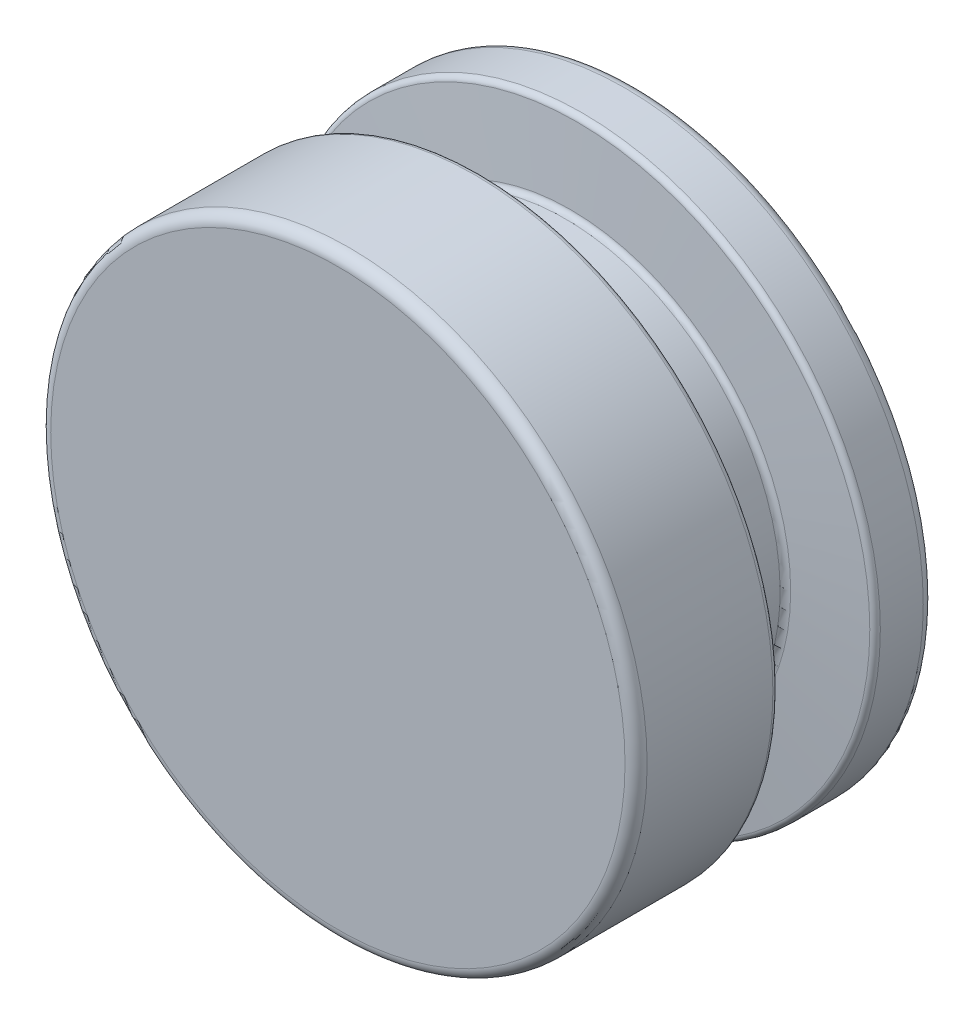
ISO-10303-21;
HEADER;
FILE_DESCRIPTION(('STEP AP214'),'2;1');
FILE_NAME('part.step','',(''),(''),'','','');
FILE_SCHEMA(('AUTOMOTIVE_DESIGN { 1 0 10303 214 1 1 1 1 }'));
ENDSEC;
DATA;
#1=APPLICATION_CONTEXT('core data for automotive mechanical design processes');
#2=APPLICATION_PROTOCOL_DEFINITION('international standard','automotive_design',2000,#1);
#3=PRODUCT_CONTEXT('',#1,'mechanical');
#4=PRODUCT('Part','Part','',(#3));
#5=PRODUCT_RELATED_PRODUCT_CATEGORY('part','',(#4));
#6=PRODUCT_DEFINITION_FORMATION('','',#4);
#7=PRODUCT_DEFINITION_CONTEXT('part definition',#1,'design');
#8=PRODUCT_DEFINITION('design','',#6,#7);
#9=PRODUCT_DEFINITION_SHAPE('','',#8);
#10=(LENGTH_UNIT() NAMED_UNIT(*) SI_UNIT(.MILLI.,.METRE.));
#11=(NAMED_UNIT(*) PLANE_ANGLE_UNIT() SI_UNIT($,.RADIAN.));
#12=(NAMED_UNIT(*) SI_UNIT($,.STERADIAN.) SOLID_ANGLE_UNIT());
#13=UNCERTAINTY_MEASURE_WITH_UNIT(LENGTH_MEASURE(1.E-05),#10,'distance_accuracy_value','');
#14=(GEOMETRIC_REPRESENTATION_CONTEXT(3) GLOBAL_UNCERTAINTY_ASSIGNED_CONTEXT((#13)) GLOBAL_UNIT_ASSIGNED_CONTEXT((#10,
#11,#12)) REPRESENTATION_CONTEXT('',''));
#15=CARTESIAN_POINT('',(0.,0.,0.));
#16=DIRECTION('',(0.,0.,1.));
#17=DIRECTION('',(1.,0.,0.));
#18=AXIS2_PLACEMENT_3D('',#15,#16,#17);
#19=CARTESIAN_POINT('',(0.,0.,-50.8));
#20=DIRECTION('',(0.,0.,1.));
#21=DIRECTION('',(1.,0.,0.));
#22=AXIS2_PLACEMENT_3D('',#19,#20,#21);
#23=CYLINDRICAL_SURFACE('',#22,68.57365);
#24=CARTESIAN_POINT('',(0.,0.,15.24));
#25=DIRECTION('',(0.,0.,1.));
#26=DIRECTION('',(1.,0.,0.));
#27=AXIS2_PLACEMENT_3D('',#24,#25,#26);
#28=CIRCLE('',#27,68.57365);
#29=CARTESIAN_POINT('',(68.57365,0.,15.24));
#30=VERTEX_POINT('',#29);
#31=EDGE_CURVE('E51',#30,#30,#28,.F.);
#32=ORIENTED_EDGE('',*,*,#31,.T.);
#33=EDGE_LOOP('',(#32));
#34=FACE_BOUND('',#33,.T.);
#35=CARTESIAN_POINT('',(0.,0.,-13.679600368829));
#36=DIRECTION('',(0.,0.,-1.));
#37=DIRECTION('',(0.,1.,0.));
#38=AXIS2_PLACEMENT_3D('',#35,#36,#37);
#39=CIRCLE('',#38,68.57365);
#40=CARTESIAN_POINT('',(0.,68.57365,-13.679600368829));
#41=VERTEX_POINT('',#40);
#42=EDGE_CURVE('E60',#41,#41,#39,.F.);
#43=ORIENTED_EDGE('',*,*,#42,.T.);
#44=EDGE_LOOP('',(#43));
#45=FACE_BOUND('',#44,.T.);
#46=ADVANCED_FACE('F40',(#34,#45),#23,.T.);
#47=CARTESIAN_POINT('',(0.,0.,17.78));
#48=DIRECTION('',(0.,0.,1.));
#49=DIRECTION('',(1.,0.,0.));
#50=AXIS2_PLACEMENT_3D('',#47,#48,#49);
#51=PLANE('',#50);
#52=CARTESIAN_POINT('',(0.,0.,17.78));
#53=DIRECTION('',(0.,0.,1.));
#54=DIRECTION('',(1.,0.,0.));
#55=AXIS2_PLACEMENT_3D('',#52,#53,#54);
#56=CIRCLE('',#55,66.03365);
#57=CARTESIAN_POINT('',(66.03365,0.,17.78));
#58=VERTEX_POINT('',#57);
#59=EDGE_CURVE('E55',#58,#58,#56,.T.);
#60=ORIENTED_EDGE('',*,*,#59,.T.);
#61=EDGE_LOOP('',(#60));
#62=FACE_BOUND('',#61,.T.);
#63=ADVANCED_FACE('F96',(#62),#51,.T.);
#64=CARTESIAN_POINT('',(0.,0.,-14.8433409598311));
#65=DIRECTION('',(0.,0.,1.));
#66=DIRECTION('',(0.,-1.,0.));
#67=AXIS2_PLACEMENT_3D('',#64,#65,#66);
#68=CONICAL_SURFACE('',#67,68.57365,1.48352986419518);
#69=CARTESIAN_POINT('',(0.,0.,-16.4085733244257));
#70=DIRECTION('',(0.,0.,1.));
#71=DIRECTION('',(0.,-1.,0.));
#72=AXIS2_PLACEMENT_3D('',#69,#70,#71);
#73=CIRCLE('',#72,50.6829622067105);
#74=CARTESIAN_POINT('',(0.,-50.6829622067105,-16.4085733244257));
#75=VERTEX_POINT('',#74);
#76=EDGE_CURVE('E78',#75,#75,#73,.T.);
#77=ORIENTED_EDGE('',*,*,#76,.T.);
#78=EDGE_LOOP('',(#77));
#79=FACE_BOUND('',#78,.T.);
#80=CARTESIAN_POINT('',(0.,0.,-14.9447676354055));
#81=DIRECTION('',(0.,0.,-1.));
#82=DIRECTION('',(0.,1.,0.));
#83=AXIS2_PLACEMENT_3D('',#80,#81,#82);
#84=CIRCLE('',#83,67.4143377932895);
#85=CARTESIAN_POINT('',(0.,67.4143377932895,-14.9447676354055));
#86=VERTEX_POINT('',#85);
#87=EDGE_CURVE('E81',#86,#86,#84,.T.);
#88=ORIENTED_EDGE('',*,*,#87,.T.);
#89=EDGE_LOOP('',(#88));
#90=FACE_BOUND('',#89,.T.);
#91=ADVANCED_FACE('F85',(#79,#90),#68,.T.);
#92=CARTESIAN_POINT('',(0.,0.,-35.56));
#93=DIRECTION('',(0.,0.,-1.));
#94=DIRECTION('',(0.,1.,0.));
#95=AXIS2_PLACEMENT_3D('',#92,#93,#94);
#96=CONICAL_SURFACE('',#95,49.52365,1.48352986419518);
#97=CARTESIAN_POINT('',(0.,0.,-35.6614266755744));
#98=DIRECTION('',(0.,0.,-1.));
#99=DIRECTION('',(0.,1.,0.));
#100=AXIS2_PLACEMENT_3D('',#97,#98,#99);
#101=CIRCLE('',#100,50.6829622067105);
#102=CARTESIAN_POINT('',(0.,50.6829622067105,-35.6614266755744));
#103=VERTEX_POINT('',#102);
#104=EDGE_CURVE('E66',#103,#103,#101,.T.);
#105=ORIENTED_EDGE('',*,*,#104,.T.);
#106=EDGE_LOOP('',(#105));
#107=FACE_BOUND('',#106,.T.);
#108=CARTESIAN_POINT('',(0.,0.,-37.1252323645945));
#109=DIRECTION('',(0.,0.,1.));
#110=DIRECTION('',(0.,-1.,0.));
#111=AXIS2_PLACEMENT_3D('',#108,#109,#110);
#112=CIRCLE('',#111,67.4143377932895);
#113=CARTESIAN_POINT('',(0.,-67.4143377932895,-37.1252323645946));
#114=VERTEX_POINT('',#113);
#115=EDGE_CURVE('E69',#114,#114,#112,.T.);
#116=ORIENTED_EDGE('',*,*,#115,.T.);
#117=EDGE_LOOP('',(#116));
#118=FACE_BOUND('',#117,.T.);
#119=ADVANCED_FACE('F125',(#107,#118),#96,.T.);
#120=CARTESIAN_POINT('',(0.,0.,17.78));
#121=DIRECTION('',(0.,0.,1.));
#122=DIRECTION('',(0.,-1.,0.));
#123=AXIS2_PLACEMENT_3D('',#120,#121,#122);
#124=CYLINDRICAL_SURFACE('',#123,49.52365);
#125=CARTESIAN_POINT('',(0.,0.,-17.6737405910021));
#126=DIRECTION('',(0.,0.,1.));
#127=DIRECTION('',(0.,-1.,0.));
#128=AXIS2_PLACEMENT_3D('',#125,#126,#127);
#129=CIRCLE('',#128,49.52365);
#130=CARTESIAN_POINT('',(0.,-49.52365,-17.6737405910021));
#131=VERTEX_POINT('',#130);
#132=EDGE_CURVE('E72',#131,#131,#129,.F.);
#133=ORIENTED_EDGE('',*,*,#132,.T.);
#134=EDGE_LOOP('',(#133));
#135=FACE_BOUND('',#134,.T.);
#136=CARTESIAN_POINT('',(0.,0.,-34.3962594089979));
#137=DIRECTION('',(0.,0.,1.));
#138=DIRECTION('',(0.,-1.,0.));
#139=AXIS2_PLACEMENT_3D('',#136,#137,#138);
#140=CIRCLE('',#139,49.52365);
#141=CARTESIAN_POINT('',(0.,-49.52365,-34.3962594089979));
#142=VERTEX_POINT('',#141);
#143=EDGE_CURVE('E75',#142,#142,#140,.T.);
#144=ORIENTED_EDGE('',*,*,#143,.T.);
#145=EDGE_LOOP('',(#144));
#146=FACE_BOUND('',#145,.T.);
#147=ADVANCED_FACE('F116',(#135,#146),#124,.T.);
#148=CARTESIAN_POINT('',(0.,0.,-50.8));
#149=DIRECTION('',(0.,0.,1.));
#150=DIRECTION('',(1.,0.,0.));
#151=AXIS2_PLACEMENT_3D('',#148,#149,#150);
#152=PLANE('',#151);
#153=CARTESIAN_POINT('',(0.,0.,-50.8));
#154=DIRECTION('',(0.,0.,1.));
#155=DIRECTION('',(1.,0.,0.));
#156=AXIS2_PLACEMENT_3D('',#153,#154,#155);
#157=CIRCLE('',#156,66.03365);
#158=CARTESIAN_POINT('',(66.03365,0.,-50.8));
#159=VERTEX_POINT('',#158);
#160=EDGE_CURVE('E11',#159,#159,#157,.F.);
#161=ORIENTED_EDGE('',*,*,#160,.T.);
#162=EDGE_LOOP('',(#161));
#163=FACE_BOUND('',#162,.T.);
#164=ADVANCED_FACE('F109',(#163),#152,.F.);
#165=CARTESIAN_POINT('',(0.,0.,-48.26));
#166=DIRECTION('',(0.,0.,1.));
#167=DIRECTION('',(1.,0.,0.));
#168=AXIS2_PLACEMENT_3D('',#165,#166,#167);
#169=CIRCLE('',#168,68.57365);
#170=CARTESIAN_POINT('',(68.57365,0.,-48.26));
#171=VERTEX_POINT('',#170);
#172=EDGE_CURVE('E47',#171,#171,#169,.T.);
#173=ORIENTED_EDGE('',*,*,#172,.T.);
#174=EDGE_LOOP('',(#173));
#175=FACE_BOUND('',#174,.T.);
#176=CARTESIAN_POINT('',(0.,0.,-38.3903996311711));
#177=DIRECTION('',(0.,0.,-1.));
#178=DIRECTION('',(0.,1.,0.));
#179=AXIS2_PLACEMENT_3D('',#176,#177,#178);
#180=CIRCLE('',#179,68.57365);
#181=CARTESIAN_POINT('',(0.,68.57365,-38.390399631171));
#182=VERTEX_POINT('',#181);
#183=EDGE_CURVE('E63',#182,#182,#180,.T.);
#184=ORIENTED_EDGE('',*,*,#183,.T.);
#185=EDGE_LOOP('',(#184));
#186=FACE_BOUND('',#185,.T.);
#187=ADVANCED_FACE('F99',(#175,#186),#23,.T.);
#188=CARTESIAN_POINT('',(0.,0.,-17.6737405910021));
#189=DIRECTION('',(0.,0.,1.));
#190=DIRECTION('',(0.,-1.,0.));
#191=AXIS2_PLACEMENT_3D('',#188,#189,#190);
#192=TOROIDAL_SURFACE('',#191,50.79365,1.27);
#193=ORIENTED_EDGE('',*,*,#132,.F.);
#194=EDGE_LOOP('',(#193));
#195=FACE_BOUND('',#194,.T.);
#196=ORIENTED_EDGE('',*,*,#76,.F.);
#197=EDGE_LOOP('',(#196));
#198=FACE_BOUND('',#197,.T.);
#199=ADVANCED_FACE('F108',(#195,#198),#192,.F.);
#200=CARTESIAN_POINT('',(0.,0.,-34.3962594089979));
#201=DIRECTION('',(0.,0.,1.));
#202=DIRECTION('',(0.,-1.,0.));
#203=AXIS2_PLACEMENT_3D('',#200,#201,#202);
#204=TOROIDAL_SURFACE('',#203,50.79365,1.27);
#205=ORIENTED_EDGE('',*,*,#104,.F.);
#206=EDGE_LOOP('',(#205));
#207=FACE_BOUND('',#206,.T.);
#208=ORIENTED_EDGE('',*,*,#143,.F.);
#209=EDGE_LOOP('',(#208));
#210=FACE_BOUND('',#209,.T.);
#211=ADVANCED_FACE('F114',(#207,#210),#204,.F.);
#212=CARTESIAN_POINT('',(0.,0.,-38.3903996311711));
#213=DIRECTION('',(0.,0.,-1.));
#214=DIRECTION('',(0.,1.,0.));
#215=AXIS2_PLACEMENT_3D('',#212,#213,#214);
#216=TOROIDAL_SURFACE('',#215,67.30365,1.27);
#217=ORIENTED_EDGE('',*,*,#183,.F.);
#218=EDGE_LOOP('',(#217));
#219=FACE_BOUND('',#218,.T.);
#220=ORIENTED_EDGE('',*,*,#115,.F.);
#221=EDGE_LOOP('',(#220));
#222=FACE_BOUND('',#221,.T.);
#223=ADVANCED_FACE('F91',(#219,#222),#216,.T.);
#224=CARTESIAN_POINT('',(0.,0.,-13.679600368829));
#225=DIRECTION('',(0.,0.,-1.));
#226=DIRECTION('',(0.,1.,0.));
#227=AXIS2_PLACEMENT_3D('',#224,#225,#226);
#228=TOROIDAL_SURFACE('',#227,67.30365,1.27);
#229=ORIENTED_EDGE('',*,*,#87,.F.);
#230=EDGE_LOOP('',(#229));
#231=FACE_BOUND('',#230,.T.);
#232=ORIENTED_EDGE('',*,*,#42,.F.);
#233=EDGE_LOOP('',(#232));
#234=FACE_BOUND('',#233,.T.);
#235=ADVANCED_FACE('F87',(#231,#234),#228,.T.);
#236=CARTESIAN_POINT('',(0.,0.,15.24));
#237=DIRECTION('',(0.,0.,1.));
#238=DIRECTION('',(1.,0.,0.));
#239=AXIS2_PLACEMENT_3D('',#236,#237,#238);
#240=TOROIDAL_SURFACE('',#239,66.03365,2.54);
#241=ORIENTED_EDGE('',*,*,#31,.F.);
#242=EDGE_LOOP('',(#241));
#243=FACE_BOUND('',#242,.T.);
#244=ORIENTED_EDGE('',*,*,#59,.F.);
#245=EDGE_LOOP('',(#244));
#246=FACE_BOUND('',#245,.T.);
#247=ADVANCED_FACE('F90',(#243,#246),#240,.T.);
#248=CARTESIAN_POINT('',(0.,0.,-48.26));
#249=DIRECTION('',(0.,0.,1.));
#250=DIRECTION('',(1.,0.,0.));
#251=AXIS2_PLACEMENT_3D('',#248,#249,#250);
#252=TOROIDAL_SURFACE('',#251,66.03365,2.54);
#253=ORIENTED_EDGE('',*,*,#160,.F.);
#254=EDGE_LOOP('',(#253));
#255=FACE_BOUND('',#254,.T.);
#256=ORIENTED_EDGE('',*,*,#172,.F.);
#257=EDGE_LOOP('',(#256));
#258=FACE_BOUND('',#257,.T.);
#259=ADVANCED_FACE('F42',(#255,#258),#252,.T.);
#260=CLOSED_SHELL('',(#46,#63,#91,#119,#147,#164,#187,#199,#211,#223,#235,#247,#259));
#261=MANIFOLD_SOLID_BREP('B2',#260);
#262=ADVANCED_BREP_SHAPE_REPRESENTATION('',(#18,#261),#14);
#263=SHAPE_DEFINITION_REPRESENTATION(#9,#262);
ENDSEC;
END-ISO-10303-21;
